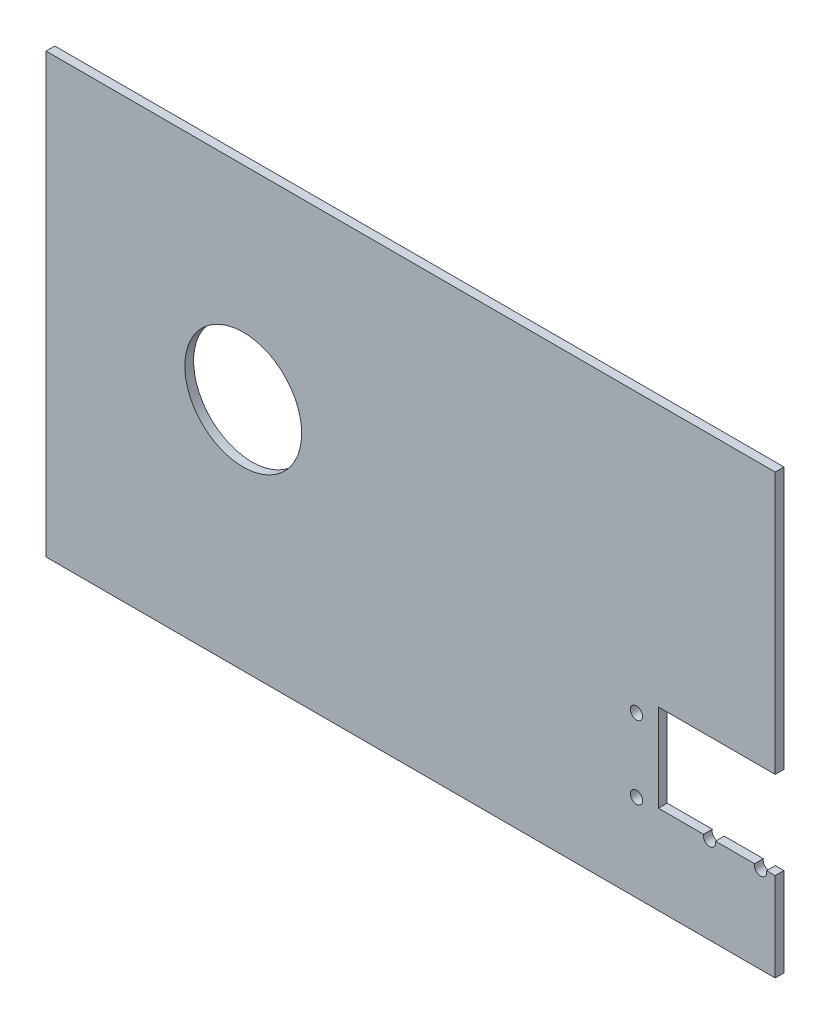
ISO-10303-21;
HEADER;
FILE_DESCRIPTION(('STEP AP214'),'2;1');
FILE_NAME('part.step','',(''),(''),'','','');
FILE_SCHEMA(('AUTOMOTIVE_DESIGN { 1 0 10303 214 1 1 1 1 }'));
ENDSEC;
DATA;
#1=APPLICATION_CONTEXT('core data for automotive mechanical design processes');
#2=APPLICATION_PROTOCOL_DEFINITION('international standard','automotive_design',2000,#1);
#3=PRODUCT_CONTEXT('',#1,'mechanical');
#4=PRODUCT('Part','Part','',(#3));
#5=PRODUCT_RELATED_PRODUCT_CATEGORY('part','',(#4));
#6=PRODUCT_DEFINITION_FORMATION('','',#4);
#7=PRODUCT_DEFINITION_CONTEXT('part definition',#1,'design');
#8=PRODUCT_DEFINITION('design','',#6,#7);
#9=PRODUCT_DEFINITION_SHAPE('','',#8);
#10=(LENGTH_UNIT() NAMED_UNIT(*) SI_UNIT(.MILLI.,.METRE.));
#11=(NAMED_UNIT(*) PLANE_ANGLE_UNIT() SI_UNIT($,.RADIAN.));
#12=(NAMED_UNIT(*) SI_UNIT($,.STERADIAN.) SOLID_ANGLE_UNIT());
#13=UNCERTAINTY_MEASURE_WITH_UNIT(LENGTH_MEASURE(1.E-05),#10,'distance_accuracy_value','');
#14=(GEOMETRIC_REPRESENTATION_CONTEXT(3) GLOBAL_UNCERTAINTY_ASSIGNED_CONTEXT((#13)) GLOBAL_UNIT_ASSIGNED_CONTEXT((#10,
#11,#12)) REPRESENTATION_CONTEXT('',''));
#15=CARTESIAN_POINT('',(0.,0.,0.));
#16=DIRECTION('',(0.,0.,1.));
#17=DIRECTION('',(1.,0.,0.));
#18=AXIS2_PLACEMENT_3D('',#15,#16,#17);
#19=CARTESIAN_POINT('',(209.6,-119.652337216124,-2.));
#20=DIRECTION('',(0.,-1.,0.));
#21=DIRECTION('',(0.,0.,-1.));
#22=AXIS2_PLACEMENT_3D('',#19,#20,#21);
#23=PLANE('',#22);
#24=DIRECTION('',(1.,0.,0.));
#25=VECTOR('',#24,1.);
#26=CARTESIAN_POINT('',(0.,-119.652337216124,0.));
#27=LINE('',#26,#25);
#28=CARTESIAN_POINT('',(229.139607805437,-119.652337216124,0.));
#29=VERTEX_POINT('',#28);
#30=CARTESIAN_POINT('',(242.560392194563,-119.652337216124,0.));
#31=VERTEX_POINT('',#30);
#32=EDGE_CURVE('E211',#29,#31,#27,.T.);
#33=ORIENTED_EDGE('',*,*,#32,.F.);
#34=DIRECTION('',(0.,0.,1.));
#35=VECTOR('',#34,1.);
#36=CARTESIAN_POINT('',(229.139607805437,-119.652337216124,0.));
#37=LINE('',#36,#35);
#38=CARTESIAN_POINT('',(229.139607805437,-119.652337216124,3.));
#39=VERTEX_POINT('',#38);
#40=EDGE_CURVE('E11',#29,#39,#37,.T.);
#41=ORIENTED_EDGE('',*,*,#40,.T.);
#42=DIRECTION('',(1.,0.,0.));
#43=VECTOR('',#42,1.);
#44=CARTESIAN_POINT('',(209.6,-119.652337216124,3.));
#45=LINE('',#44,#43);
#46=CARTESIAN_POINT('',(242.560392194563,-119.652337216124,3.));
#47=VERTEX_POINT('',#46);
#48=EDGE_CURVE('E144',#39,#47,#45,.T.);
#49=ORIENTED_EDGE('',*,*,#48,.T.);
#50=DIRECTION('',(0.,0.,1.));
#51=VECTOR('',#50,1.);
#52=CARTESIAN_POINT('',(242.560392194563,-119.652337216124,0.));
#53=LINE('',#52,#51);
#54=EDGE_CURVE('E124',#47,#31,#53,.F.);
#55=ORIENTED_EDGE('',*,*,#54,.T.);
#56=EDGE_LOOP('',(#33,#41,#49,#55));
#57=FACE_BOUND('',#56,.T.);
#58=ADVANCED_FACE('F33',(#57),#23,.F.);
#59=CARTESIAN_POINT('',(246.639607805437,-119.652337216124,0.));
#60=VERTEX_POINT('',#59);
#61=CARTESIAN_POINT('',(249.6,-119.652337216124,0.));
#62=VERTEX_POINT('',#61);
#63=EDGE_CURVE('E136',#60,#62,#27,.T.);
#64=ORIENTED_EDGE('',*,*,#63,.F.);
#65=DIRECTION('',(0.,0.,1.));
#66=VECTOR('',#65,1.);
#67=CARTESIAN_POINT('',(246.639607805437,-119.652337216124,0.));
#68=LINE('',#67,#66);
#69=CARTESIAN_POINT('',(246.639607805437,-119.652337216124,3.));
#70=VERTEX_POINT('',#69);
#71=EDGE_CURVE('E123',#60,#70,#68,.T.);
#72=ORIENTED_EDGE('',*,*,#71,.T.);
#73=CARTESIAN_POINT('',(249.6,-119.652337216124,3.));
#74=VERTEX_POINT('',#73);
#75=EDGE_CURVE('E134',#70,#74,#45,.T.);
#76=ORIENTED_EDGE('',*,*,#75,.T.);
#77=DIRECTION('',(0.,0.,1.));
#78=VECTOR('',#77,1.);
#79=CARTESIAN_POINT('',(249.6,-119.652337216124,-2.));
#80=LINE('',#79,#78);
#81=EDGE_CURVE('E161',#62,#74,#80,.T.);
#82=ORIENTED_EDGE('',*,*,#81,.F.);
#83=EDGE_LOOP('',(#64,#72,#76,#82));
#84=FACE_BOUND('',#83,.T.);
#85=ADVANCED_FACE('F132',(#84),#23,.F.);
#86=CARTESIAN_POINT('',(249.6,0.,3.));
#87=DIRECTION('',(-1.,0.,0.));
#88=DIRECTION('',(0.,-1.,0.));
#89=AXIS2_PLACEMENT_3D('',#86,#87,#88);
#90=PLANE('',#89);
#91=DIRECTION('',(0.,1.,0.));
#92=VECTOR('',#91,1.);
#93=CARTESIAN_POINT('',(249.6,0.,3.));
#94=LINE('',#93,#92);
#95=CARTESIAN_POINT('',(249.6,-89.6523372161239,3.));
#96=VERTEX_POINT('',#95);
#97=CARTESIAN_POINT('',(249.6,0.,3.));
#98=VERTEX_POINT('',#97);
#99=EDGE_CURVE('E182',#96,#98,#94,.T.);
#100=ORIENTED_EDGE('',*,*,#99,.F.);
#101=DIRECTION('',(0.,0.,1.));
#102=VECTOR('',#101,1.);
#103=CARTESIAN_POINT('',(249.6,-89.6523372161239,-2.));
#104=LINE('',#103,#102);
#105=CARTESIAN_POINT('',(249.6,-89.6523372161239,0.));
#106=VERTEX_POINT('',#105);
#107=EDGE_CURVE('E167',#106,#96,#104,.T.);
#108=ORIENTED_EDGE('',*,*,#107,.F.);
#109=DIRECTION('',(0.,1.,0.));
#110=VECTOR('',#109,1.);
#111=CARTESIAN_POINT('',(249.6,0.,0.));
#112=LINE('',#111,#110);
#113=CARTESIAN_POINT('',(249.6,0.,0.));
#114=VERTEX_POINT('',#113);
#115=EDGE_CURVE('E191',#106,#114,#112,.T.);
#116=ORIENTED_EDGE('',*,*,#115,.T.);
#117=DIRECTION('',(0.,0.,-1.));
#118=VECTOR('',#117,1.);
#119=CARTESIAN_POINT('',(249.6,0.,3.));
#120=LINE('',#119,#118);
#121=EDGE_CURVE('E198',#98,#114,#120,.T.);
#122=ORIENTED_EDGE('',*,*,#121,.F.);
#123=EDGE_LOOP('',(#100,#108,#116,#122));
#124=FACE_BOUND('',#123,.T.);
#125=ADVANCED_FACE('F230',(#124),#90,.F.);
#126=CARTESIAN_POINT('',(0.,0.,3.));
#127=DIRECTION('',(1.,0.,0.));
#128=DIRECTION('',(0.,0.,-1.));
#129=AXIS2_PLACEMENT_3D('',#126,#127,#128);
#130=PLANE('',#129);
#131=DIRECTION('',(0.,-1.,0.));
#132=VECTOR('',#131,1.);
#133=CARTESIAN_POINT('',(0.,0.,0.));
#134=LINE('',#133,#132);
#135=CARTESIAN_POINT('',(0.,0.,0.));
#136=VERTEX_POINT('',#135);
#137=CARTESIAN_POINT('',(0.,-150.,0.));
#138=VERTEX_POINT('',#137);
#139=EDGE_CURVE('E173',#136,#138,#134,.T.);
#140=ORIENTED_EDGE('',*,*,#139,.T.);
#141=DIRECTION('',(0.,0.,-1.));
#142=VECTOR('',#141,1.);
#143=CARTESIAN_POINT('',(0.,-150.,3.));
#144=LINE('',#143,#142);
#145=CARTESIAN_POINT('',(0.,-150.,3.));
#146=VERTEX_POINT('',#145);
#147=EDGE_CURVE('E204',#146,#138,#144,.T.);
#148=ORIENTED_EDGE('',*,*,#147,.F.);
#149=DIRECTION('',(0.,-1.,0.));
#150=VECTOR('',#149,1.);
#151=CARTESIAN_POINT('',(0.,0.,3.));
#152=LINE('',#151,#150);
#153=CARTESIAN_POINT('',(0.,0.,3.));
#154=VERTEX_POINT('',#153);
#155=EDGE_CURVE('E176',#154,#146,#152,.T.);
#156=ORIENTED_EDGE('',*,*,#155,.F.);
#157=DIRECTION('',(0.,0.,-1.));
#158=VECTOR('',#157,1.);
#159=CARTESIAN_POINT('',(0.,0.,3.));
#160=LINE('',#159,#158);
#161=EDGE_CURVE('E186',#154,#136,#160,.T.);
#162=ORIENTED_EDGE('',*,*,#161,.T.);
#163=EDGE_LOOP('',(#140,#148,#156,#162));
#164=FACE_BOUND('',#163,.T.);
#165=ADVANCED_FACE('F35',(#164),#130,.F.);
#166=CARTESIAN_POINT('',(0.,-150.,3.));
#167=DIRECTION('',(0.,1.,0.));
#168=DIRECTION('',(0.,0.,1.));
#169=AXIS2_PLACEMENT_3D('',#166,#167,#168);
#170=PLANE('',#169);
#171=DIRECTION('',(1.,0.,0.));
#172=VECTOR('',#171,1.);
#173=CARTESIAN_POINT('',(0.,-150.,0.));
#174=LINE('',#173,#172);
#175=CARTESIAN_POINT('',(249.6,-150.,0.));
#176=VERTEX_POINT('',#175);
#177=EDGE_CURVE('E189',#138,#176,#174,.T.);
#178=ORIENTED_EDGE('',*,*,#177,.T.);
#179=DIRECTION('',(0.,0.,-1.));
#180=VECTOR('',#179,1.);
#181=CARTESIAN_POINT('',(249.6,-150.,3.));
#182=LINE('',#181,#180);
#183=CARTESIAN_POINT('',(249.6,-150.,3.));
#184=VERTEX_POINT('',#183);
#185=EDGE_CURVE('E201',#184,#176,#182,.T.);
#186=ORIENTED_EDGE('',*,*,#185,.F.);
#187=DIRECTION('',(1.,0.,0.));
#188=VECTOR('',#187,1.);
#189=CARTESIAN_POINT('',(0.,-150.,3.));
#190=LINE('',#189,#188);
#191=EDGE_CURVE('E179',#146,#184,#190,.T.);
#192=ORIENTED_EDGE('',*,*,#191,.F.);
#193=ORIENTED_EDGE('',*,*,#147,.T.);
#194=EDGE_LOOP('',(#178,#186,#192,#193));
#195=FACE_BOUND('',#194,.T.);
#196=ADVANCED_FACE('F314',(#195),#170,.F.);
#197=EDGE_CURVE('E192',#176,#62,#112,.T.);
#198=ORIENTED_EDGE('',*,*,#197,.T.);
#199=ORIENTED_EDGE('',*,*,#81,.T.);
#200=EDGE_CURVE('E143',#184,#74,#94,.T.);
#201=ORIENTED_EDGE('',*,*,#200,.F.);
#202=ORIENTED_EDGE('',*,*,#185,.T.);
#203=EDGE_LOOP('',(#198,#199,#201,#202));
#204=FACE_BOUND('',#203,.T.);
#205=ADVANCED_FACE('F309',(#204),#90,.F.);
#206=CARTESIAN_POINT('',(0.,0.,3.));
#207=DIRECTION('',(0.,-1.,0.));
#208=DIRECTION('',(0.,0.,-1.));
#209=AXIS2_PLACEMENT_3D('',#206,#207,#208);
#210=PLANE('',#209);
#211=DIRECTION('',(-1.,0.,0.));
#212=VECTOR('',#211,1.);
#213=CARTESIAN_POINT('',(0.,0.,0.));
#214=LINE('',#213,#212);
#215=EDGE_CURVE('E180',#114,#136,#214,.T.);
#216=ORIENTED_EDGE('',*,*,#215,.T.);
#217=ORIENTED_EDGE('',*,*,#161,.F.);
#218=DIRECTION('',(-1.,0.,0.));
#219=VECTOR('',#218,1.);
#220=CARTESIAN_POINT('',(0.,0.,3.));
#221=LINE('',#220,#219);
#222=EDGE_CURVE('E184',#98,#154,#221,.T.);
#223=ORIENTED_EDGE('',*,*,#222,.F.);
#224=ORIENTED_EDGE('',*,*,#121,.T.);
#225=EDGE_LOOP('',(#216,#217,#223,#224));
#226=FACE_BOUND('',#225,.T.);
#227=ADVANCED_FACE('F236',(#226),#210,.F.);
#228=CARTESIAN_POINT('',(0.,0.,3.));
#229=DIRECTION('',(0.,0.,1.));
#230=DIRECTION('',(1.,0.,0.));
#231=AXIS2_PLACEMENT_3D('',#228,#229,#230);
#232=PLANE('',#231);
#233=CARTESIAN_POINT('',(202.1,-95.1523372161239,3.));
#234=DIRECTION('',(0.,0.,1.));
#235=DIRECTION('',(1.,0.,0.));
#236=AXIS2_PLACEMENT_3D('',#233,#234,#235);
#237=CIRCLE('',#236,2.09999999999999);
#238=CARTESIAN_POINT('',(204.2,-95.1523372161239,3.));
#239=VERTEX_POINT('',#238);
#240=EDGE_CURVE('E255',#239,#239,#237,.T.);
#241=ORIENTED_EDGE('',*,*,#240,.F.);
#242=EDGE_LOOP('',(#241));
#243=FACE_BOUND('',#242,.T.);
#244=CARTESIAN_POINT('',(202.1,-120.152337216124,3.));
#245=DIRECTION('',(0.,0.,1.));
#246=DIRECTION('',(1.,0.,0.));
#247=AXIS2_PLACEMENT_3D('',#244,#245,#246);
#248=CIRCLE('',#247,2.09999999999999);
#249=CARTESIAN_POINT('',(204.2,-120.152337216124,3.));
#250=VERTEX_POINT('',#249);
#251=EDGE_CURVE('E247',#250,#250,#248,.T.);
#252=ORIENTED_EDGE('',*,*,#251,.F.);
#253=EDGE_LOOP('',(#252));
#254=FACE_BOUND('',#253,.T.);
#255=CARTESIAN_POINT('',(227.1,-120.152337216124,3.));
#256=DIRECTION('',(0.,0.,1.));
#257=DIRECTION('',(1.,0.,0.));
#258=AXIS2_PLACEMENT_3D('',#255,#256,#257);
#259=CIRCLE('',#258,2.10000000000002);
#260=CARTESIAN_POINT('',(225.060392194563,-119.652337216124,3.));
#261=VERTEX_POINT('',#260);
#262=EDGE_CURVE('E242',#261,#39,#259,.T.);
#263=ORIENTED_EDGE('',*,*,#262,.F.);
#264=CARTESIAN_POINT('',(209.6,-119.652337216124,3.));
#265=VERTEX_POINT('',#264);
#266=EDGE_CURVE('E147',#265,#261,#45,.T.);
#267=ORIENTED_EDGE('',*,*,#266,.F.);
#268=DIRECTION('',(0.,-1.,0.));
#269=VECTOR('',#268,1.);
#270=CARTESIAN_POINT('',(209.6,-89.6523372161239,3.));
#271=LINE('',#270,#269);
#272=CARTESIAN_POINT('',(209.6,-89.6523372161239,3.));
#273=VERTEX_POINT('',#272);
#274=EDGE_CURVE('E145',#273,#265,#271,.T.);
#275=ORIENTED_EDGE('',*,*,#274,.F.);
#276=DIRECTION('',(-1.,0.,0.));
#277=VECTOR('',#276,1.);
#278=CARTESIAN_POINT('',(209.6,-89.6523372161239,3.));
#279=LINE('',#278,#277);
#280=EDGE_CURVE('E152',#96,#273,#279,.T.);
#281=ORIENTED_EDGE('',*,*,#280,.F.);
#282=ORIENTED_EDGE('',*,*,#99,.T.);
#283=ORIENTED_EDGE('',*,*,#222,.T.);
#284=ORIENTED_EDGE('',*,*,#155,.T.);
#285=ORIENTED_EDGE('',*,*,#191,.T.);
#286=ORIENTED_EDGE('',*,*,#200,.T.);
#287=ORIENTED_EDGE('',*,*,#75,.F.);
#288=CARTESIAN_POINT('',(244.6,-120.152337216124,3.));
#289=DIRECTION('',(0.,0.,1.));
#290=DIRECTION('',(1.,0.,0.));
#291=AXIS2_PLACEMENT_3D('',#288,#289,#290);
#292=CIRCLE('',#291,2.09999999999999);
#293=EDGE_CURVE('E120',#47,#70,#292,.T.);
#294=ORIENTED_EDGE('',*,*,#293,.F.);
#295=ORIENTED_EDGE('',*,*,#48,.F.);
#296=EDGE_LOOP('',(#263,#267,#275,#281,#282,#283,#284,#285,#286,#287,#294,#295));
#297=FACE_BOUND('',#296,.T.);
#298=CARTESIAN_POINT('',(67.5000000000002,-69.5849433204151,3.));
#299=DIRECTION('',(0.,0.,1.));
#300=DIRECTION('',(1.,0.,0.));
#301=AXIS2_PLACEMENT_3D('',#298,#299,#300);
#302=CIRCLE('',#301,20.);
#303=CARTESIAN_POINT('',(87.5000000000002,-69.5849433204151,3.));
#304=VERTEX_POINT('',#303);
#305=EDGE_CURVE('E166',#304,#304,#302,.T.);
#306=ORIENTED_EDGE('',*,*,#305,.F.);
#307=EDGE_LOOP('',(#306));
#308=FACE_BOUND('',#307,.T.);
#309=ADVANCED_FACE('F140',(#243,#254,#297,#308),#232,.T.);
#310=CARTESIAN_POINT('',(0.,0.,0.));
#311=DIRECTION('',(0.,0.,1.));
#312=DIRECTION('',(1.,0.,0.));
#313=AXIS2_PLACEMENT_3D('',#310,#311,#312);
#314=PLANE('',#313);
#315=CARTESIAN_POINT('',(202.1,-95.1523372161239,0.));
#316=DIRECTION('',(0.,0.,1.));
#317=DIRECTION('',(1.,0.,0.));
#318=AXIS2_PLACEMENT_3D('',#315,#316,#317);
#319=CIRCLE('',#318,2.09999999999999);
#320=CARTESIAN_POINT('',(204.2,-95.1523372161239,0.));
#321=VERTEX_POINT('',#320);
#322=EDGE_CURVE('E252',#321,#321,#319,.T.);
#323=ORIENTED_EDGE('',*,*,#322,.T.);
#324=EDGE_LOOP('',(#323));
#325=FACE_BOUND('',#324,.T.);
#326=CARTESIAN_POINT('',(202.1,-120.152337216124,0.));
#327=DIRECTION('',(0.,0.,1.));
#328=DIRECTION('',(1.,0.,0.));
#329=AXIS2_PLACEMENT_3D('',#326,#327,#328);
#330=CIRCLE('',#329,2.09999999999999);
#331=CARTESIAN_POINT('',(204.2,-120.152337216124,0.));
#332=VERTEX_POINT('',#331);
#333=EDGE_CURVE('E243',#332,#332,#330,.T.);
#334=ORIENTED_EDGE('',*,*,#333,.T.);
#335=EDGE_LOOP('',(#334));
#336=FACE_BOUND('',#335,.T.);
#337=CARTESIAN_POINT('',(67.5000000000002,-69.5849433204151,0.));
#338=DIRECTION('',(0.,0.,1.));
#339=DIRECTION('',(1.,0.,0.));
#340=AXIS2_PLACEMENT_3D('',#337,#338,#339);
#341=CIRCLE('',#340,20.);
#342=CARTESIAN_POINT('',(87.5000000000002,-69.5849433204151,0.));
#343=VERTEX_POINT('',#342);
#344=EDGE_CURVE('E170',#343,#343,#341,.T.);
#345=ORIENTED_EDGE('',*,*,#344,.T.);
#346=EDGE_LOOP('',(#345));
#347=FACE_BOUND('',#346,.T.);
#348=CARTESIAN_POINT('',(209.6,-119.652337216124,0.));
#349=VERTEX_POINT('',#348);
#350=CARTESIAN_POINT('',(225.060392194563,-119.652337216124,0.));
#351=VERTEX_POINT('',#350);
#352=EDGE_CURVE('E207',#349,#351,#27,.T.);
#353=ORIENTED_EDGE('',*,*,#352,.T.);
#354=CARTESIAN_POINT('',(227.1,-120.152337216124,0.));
#355=DIRECTION('',(0.,0.,1.));
#356=DIRECTION('',(1.,0.,0.));
#357=AXIS2_PLACEMENT_3D('',#354,#355,#356);
#358=CIRCLE('',#357,2.10000000000002);
#359=EDGE_CURVE('E56',#351,#29,#358,.T.);
#360=ORIENTED_EDGE('',*,*,#359,.T.);
#361=ORIENTED_EDGE('',*,*,#32,.T.);
#362=CARTESIAN_POINT('',(244.6,-120.152337216124,0.));
#363=DIRECTION('',(0.,0.,1.));
#364=DIRECTION('',(1.,0.,0.));
#365=AXIS2_PLACEMENT_3D('',#362,#363,#364);
#366=CIRCLE('',#365,2.09999999999999);
#367=EDGE_CURVE('E48',#31,#60,#366,.T.);
#368=ORIENTED_EDGE('',*,*,#367,.T.);
#369=ORIENTED_EDGE('',*,*,#63,.T.);
#370=ORIENTED_EDGE('',*,*,#197,.F.);
#371=ORIENTED_EDGE('',*,*,#177,.F.);
#372=ORIENTED_EDGE('',*,*,#139,.F.);
#373=ORIENTED_EDGE('',*,*,#215,.F.);
#374=ORIENTED_EDGE('',*,*,#115,.F.);
#375=DIRECTION('',(-1.,0.,0.));
#376=VECTOR('',#375,1.);
#377=CARTESIAN_POINT('',(0.,-89.6523372161239,0.));
#378=LINE('',#377,#376);
#379=CARTESIAN_POINT('',(209.6,-89.6523372161239,0.));
#380=VERTEX_POINT('',#379);
#381=EDGE_CURVE('E214',#106,#380,#378,.T.);
#382=ORIENTED_EDGE('',*,*,#381,.T.);
#383=DIRECTION('',(0.,-1.,0.));
#384=VECTOR('',#383,1.);
#385=CARTESIAN_POINT('',(209.6,0.,0.));
#386=LINE('',#385,#384);
#387=EDGE_CURVE('E210',#380,#349,#386,.T.);
#388=ORIENTED_EDGE('',*,*,#387,.T.);
#389=EDGE_LOOP('',(#353,#360,#361,#368,#369,#370,#371,#372,#373,#374,#382,#388));
#390=FACE_BOUND('',#389,.T.);
#391=ADVANCED_FACE('F220',(#325,#336,#347,#390),#314,.F.);
#392=CARTESIAN_POINT('',(67.5000000000002,-69.5849433204151,0.));
#393=DIRECTION('',(0.,0.,1.));
#394=DIRECTION('',(1.,0.,0.));
#395=AXIS2_PLACEMENT_3D('',#392,#393,#394);
#396=CYLINDRICAL_SURFACE('',#395,20.);
#397=ORIENTED_EDGE('',*,*,#344,.F.);
#398=EDGE_LOOP('',(#397));
#399=FACE_BOUND('',#398,.T.);
#400=ORIENTED_EDGE('',*,*,#305,.T.);
#401=EDGE_LOOP('',(#400));
#402=FACE_BOUND('',#401,.T.);
#403=ADVANCED_FACE('F287',(#399,#402),#396,.F.);
#404=CARTESIAN_POINT('',(209.6,-89.6523372161239,-2.));
#405=DIRECTION('',(-1.,0.,0.));
#406=DIRECTION('',(0.,0.,1.));
#407=AXIS2_PLACEMENT_3D('',#404,#405,#406);
#408=PLANE('',#407);
#409=DIRECTION('',(0.,0.,1.));
#410=VECTOR('',#409,1.);
#411=CARTESIAN_POINT('',(209.6,-89.6523372161239,-2.));
#412=LINE('',#411,#410);
#413=EDGE_CURVE('E164',#380,#273,#412,.T.);
#414=ORIENTED_EDGE('',*,*,#413,.T.);
#415=ORIENTED_EDGE('',*,*,#274,.T.);
#416=DIRECTION('',(0.,0.,1.));
#417=VECTOR('',#416,1.);
#418=CARTESIAN_POINT('',(209.6,-119.652337216124,-2.));
#419=LINE('',#418,#417);
#420=EDGE_CURVE('E156',#349,#265,#419,.T.);
#421=ORIENTED_EDGE('',*,*,#420,.F.);
#422=ORIENTED_EDGE('',*,*,#387,.F.);
#423=EDGE_LOOP('',(#414,#415,#421,#422));
#424=FACE_BOUND('',#423,.T.);
#425=ADVANCED_FACE('F225',(#424),#408,.F.);
#426=CARTESIAN_POINT('',(209.6,-89.6523372161239,-2.));
#427=DIRECTION('',(0.,1.,0.));
#428=DIRECTION('',(0.,0.,1.));
#429=AXIS2_PLACEMENT_3D('',#426,#427,#428);
#430=PLANE('',#429);
#431=ORIENTED_EDGE('',*,*,#107,.T.);
#432=ORIENTED_EDGE('',*,*,#280,.T.);
#433=ORIENTED_EDGE('',*,*,#413,.F.);
#434=ORIENTED_EDGE('',*,*,#381,.F.);
#435=EDGE_LOOP('',(#431,#432,#433,#434));
#436=FACE_BOUND('',#435,.T.);
#437=ADVANCED_FACE('F226',(#436),#430,.F.);
#438=ORIENTED_EDGE('',*,*,#266,.T.);
#439=DIRECTION('',(0.,0.,1.));
#440=VECTOR('',#439,1.);
#441=CARTESIAN_POINT('',(225.060392194563,-119.652337216124,0.));
#442=LINE('',#441,#440);
#443=EDGE_CURVE('E41',#261,#351,#442,.F.);
#444=ORIENTED_EDGE('',*,*,#443,.T.);
#445=ORIENTED_EDGE('',*,*,#352,.F.);
#446=ORIENTED_EDGE('',*,*,#420,.T.);
#447=EDGE_LOOP('',(#438,#444,#445,#446));
#448=FACE_BOUND('',#447,.T.);
#449=ADVANCED_FACE('F217',(#448),#23,.F.);
#450=CARTESIAN_POINT('',(244.6,-120.152337216124,0.));
#451=DIRECTION('',(0.,0.,1.));
#452=DIRECTION('',(1.,0.,0.));
#453=AXIS2_PLACEMENT_3D('',#450,#451,#452);
#454=CYLINDRICAL_SURFACE('',#453,2.09999999999999);
#455=ORIENTED_EDGE('',*,*,#367,.F.);
#456=ORIENTED_EDGE('',*,*,#54,.F.);
#457=ORIENTED_EDGE('',*,*,#293,.T.);
#458=ORIENTED_EDGE('',*,*,#71,.F.);
#459=EDGE_LOOP('',(#455,#456,#457,#458));
#460=FACE_BOUND('',#459,.T.);
#461=ADVANCED_FACE('F122',(#460),#454,.F.);
#462=CARTESIAN_POINT('',(227.1,-120.152337216124,0.));
#463=DIRECTION('',(0.,0.,1.));
#464=DIRECTION('',(1.,0.,0.));
#465=AXIS2_PLACEMENT_3D('',#462,#463,#464);
#466=CYLINDRICAL_SURFACE('',#465,2.10000000000002);
#467=ORIENTED_EDGE('',*,*,#359,.F.);
#468=ORIENTED_EDGE('',*,*,#443,.F.);
#469=ORIENTED_EDGE('',*,*,#262,.T.);
#470=ORIENTED_EDGE('',*,*,#40,.F.);
#471=EDGE_LOOP('',(#467,#468,#469,#470));
#472=FACE_BOUND('',#471,.T.);
#473=ADVANCED_FACE('F260',(#472),#466,.F.);
#474=CARTESIAN_POINT('',(202.1,-120.152337216124,0.));
#475=DIRECTION('',(0.,0.,1.));
#476=DIRECTION('',(1.,0.,0.));
#477=AXIS2_PLACEMENT_3D('',#474,#475,#476);
#478=CYLINDRICAL_SURFACE('',#477,2.09999999999999);
#479=ORIENTED_EDGE('',*,*,#333,.F.);
#480=EDGE_LOOP('',(#479));
#481=FACE_BOUND('',#480,.T.);
#482=ORIENTED_EDGE('',*,*,#251,.T.);
#483=EDGE_LOOP('',(#482));
#484=FACE_BOUND('',#483,.T.);
#485=ADVANCED_FACE('F262',(#481,#484),#478,.F.);
#486=CARTESIAN_POINT('',(202.1,-95.1523372161239,0.));
#487=DIRECTION('',(0.,0.,1.));
#488=DIRECTION('',(1.,0.,0.));
#489=AXIS2_PLACEMENT_3D('',#486,#487,#488);
#490=CYLINDRICAL_SURFACE('',#489,2.09999999999999);
#491=ORIENTED_EDGE('',*,*,#322,.F.);
#492=EDGE_LOOP('',(#491));
#493=FACE_BOUND('',#492,.T.);
#494=ORIENTED_EDGE('',*,*,#240,.T.);
#495=EDGE_LOOP('',(#494));
#496=FACE_BOUND('',#495,.T.);
#497=ADVANCED_FACE('F268',(#493,#496),#490,.F.);
#498=CLOSED_SHELL('',(#58,#85,#125,#165,#196,#205,#227,#309,#391,#403,#425,#437,#449,#461,#473,
#485,#497));
#499=MANIFOLD_SOLID_BREP('B2',#498);
#500=ADVANCED_BREP_SHAPE_REPRESENTATION('',(#18,#499),#14);
#501=SHAPE_DEFINITION_REPRESENTATION(#9,#500);
ENDSEC;
END-ISO-10303-21;
